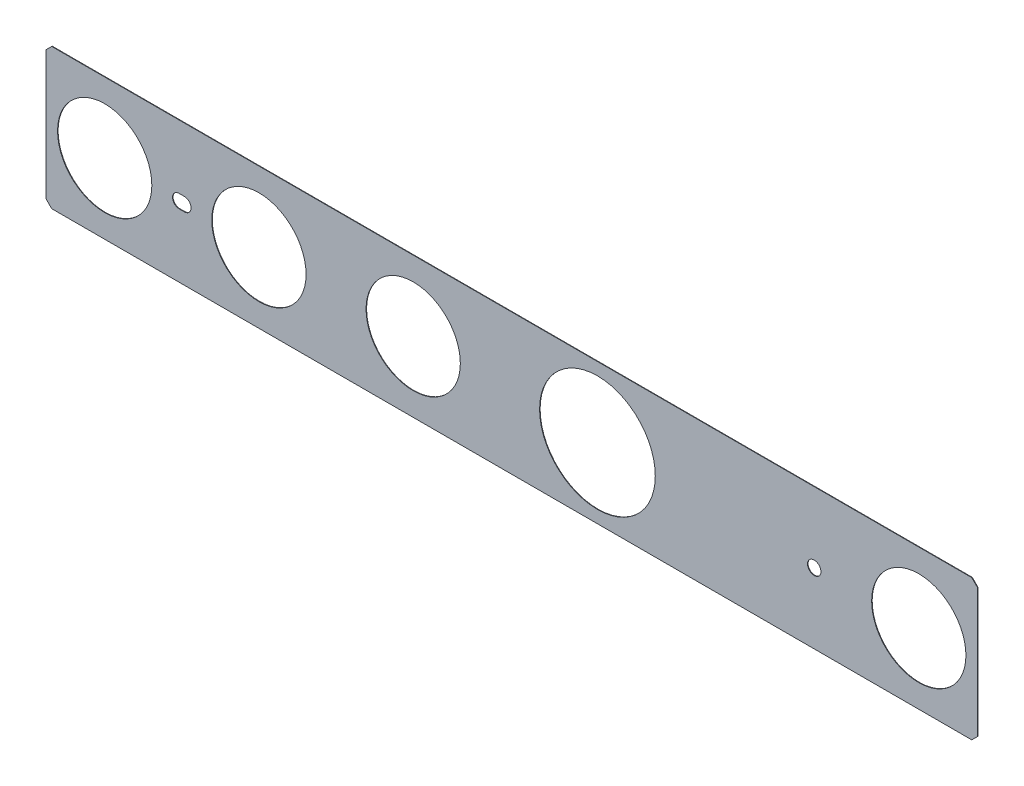
ISO-10303-21;
HEADER;
FILE_DESCRIPTION(('STEP AP214'),'2;1');
FILE_NAME('part.step','',(''),(''),'','','');
FILE_SCHEMA(('AUTOMOTIVE_DESIGN { 1 0 10303 214 1 1 1 1 }'));
ENDSEC;
DATA;
#1=APPLICATION_CONTEXT('core data for automotive mechanical design processes');
#2=APPLICATION_PROTOCOL_DEFINITION('international standard','automotive_design',2000,#1);
#3=PRODUCT_CONTEXT('',#1,'mechanical');
#4=PRODUCT('Part','Part','',(#3));
#5=PRODUCT_RELATED_PRODUCT_CATEGORY('part','',(#4));
#6=PRODUCT_DEFINITION_FORMATION('','',#4);
#7=PRODUCT_DEFINITION_CONTEXT('part definition',#1,'design');
#8=PRODUCT_DEFINITION('design','',#6,#7);
#9=PRODUCT_DEFINITION_SHAPE('','',#8);
#10=(LENGTH_UNIT() NAMED_UNIT(*) SI_UNIT(.MILLI.,.METRE.));
#11=(NAMED_UNIT(*) PLANE_ANGLE_UNIT() SI_UNIT($,.RADIAN.));
#12=(NAMED_UNIT(*) SI_UNIT($,.STERADIAN.) SOLID_ANGLE_UNIT());
#13=UNCERTAINTY_MEASURE_WITH_UNIT(LENGTH_MEASURE(1.E-05),#10,'distance_accuracy_value','');
#14=(GEOMETRIC_REPRESENTATION_CONTEXT(3) GLOBAL_UNCERTAINTY_ASSIGNED_CONTEXT((#13)) GLOBAL_UNIT_ASSIGNED_CONTEXT((#10,
#11,#12)) REPRESENTATION_CONTEXT('',''));
#15=CARTESIAN_POINT('',(0.,0.,0.));
#16=DIRECTION('',(0.,0.,1.));
#17=DIRECTION('',(1.,0.,0.));
#18=AXIS2_PLACEMENT_3D('',#15,#16,#17);
#19=CARTESIAN_POINT('',(-38.2,0.78,-2.41));
#20=DIRECTION('',(0.,1.,0.));
#21=DIRECTION('',(1.,0.,0.));
#22=AXIS2_PLACEMENT_3D('',#19,#20,#21);
#23=PLANE('',#22);
#24=DIRECTION('',(0.,0.,1.));
#25=VECTOR('',#24,1.);
#26=CARTESIAN_POINT('',(-38.2,0.78,-2.47));
#27=LINE('',#26,#25);
#28=CARTESIAN_POINT('',(-38.2,0.78,-2.47));
#29=VERTEX_POINT('',#28);
#30=CARTESIAN_POINT('',(-38.2,0.78,-2.41));
#31=VERTEX_POINT('',#30);
#32=EDGE_CURVE('E11',#29,#31,#27,.T.);
#33=ORIENTED_EDGE('',*,*,#32,.T.);
#34=DIRECTION('',(1.,0.,0.));
#35=VECTOR('',#34,1.);
#36=CARTESIAN_POINT('',(-38.8,0.78,-2.41));
#37=LINE('',#36,#35);
#38=CARTESIAN_POINT('',(-38.8,0.78,-2.41));
#39=VERTEX_POINT('',#38);
#40=EDGE_CURVE('E298',#39,#31,#37,.T.);
#41=ORIENTED_EDGE('',*,*,#40,.F.);
#42=DIRECTION('',(0.,0.,-1.));
#43=VECTOR('',#42,1.);
#44=CARTESIAN_POINT('',(-38.8,0.78,-2.41));
#45=LINE('',#44,#43);
#46=CARTESIAN_POINT('',(-38.8,0.78,-2.47));
#47=VERTEX_POINT('',#46);
#48=EDGE_CURVE('E432',#39,#47,#45,.T.);
#49=ORIENTED_EDGE('',*,*,#48,.T.);
#50=DIRECTION('',(1.,0.,0.));
#51=VECTOR('',#50,1.);
#52=CARTESIAN_POINT('',(-38.8,0.78,-2.47));
#53=LINE('',#52,#51);
#54=EDGE_CURVE('E400',#47,#29,#53,.T.);
#55=ORIENTED_EDGE('',*,*,#54,.T.);
#56=EDGE_LOOP('',(#33,#41,#49,#55));
#57=FACE_BOUND('',#56,.T.);
#58=ADVANCED_FACE('F17',(#57),#23,.F.);
#59=CARTESIAN_POINT('',(-38.2,0.,-2.41));
#60=DIRECTION('',(0.,0.,1.));
#61=DIRECTION('',(1.,0.,0.));
#62=AXIS2_PLACEMENT_3D('',#59,#60,#61);
#63=CYLINDRICAL_SURFACE('',#62,0.78);
#64=DIRECTION('',(0.,0.,-1.));
#65=VECTOR('',#64,1.);
#66=CARTESIAN_POINT('',(-38.2,-0.78,-2.41));
#67=LINE('',#66,#65);
#68=CARTESIAN_POINT('',(-38.2,-0.78,-2.41));
#69=VERTEX_POINT('',#68);
#70=CARTESIAN_POINT('',(-38.2,-0.78,-2.47));
#71=VERTEX_POINT('',#70);
#72=EDGE_CURVE('E28',#69,#71,#67,.T.);
#73=ORIENTED_EDGE('',*,*,#72,.F.);
#74=CARTESIAN_POINT('',(-38.2,0.,-2.41));
#75=DIRECTION('',(0.,0.,1.));
#76=DIRECTION('',(0.,-1.,0.));
#77=AXIS2_PLACEMENT_3D('',#74,#75,#76);
#78=CIRCLE('',#77,0.78);
#79=CARTESIAN_POINT('',(-37.42,0.,-2.41));
#80=VERTEX_POINT('',#79);
#81=EDGE_CURVE('E297',#69,#80,#78,.T.);
#82=ORIENTED_EDGE('',*,*,#81,.T.);
#83=CARTESIAN_POINT('',(-38.2,0.,-2.41));
#84=DIRECTION('',(0.,0.,1.));
#85=DIRECTION('',(1.,0.,0.));
#86=AXIS2_PLACEMENT_3D('',#83,#84,#85);
#87=CIRCLE('',#86,0.78);
#88=EDGE_CURVE('E294',#80,#31,#87,.T.);
#89=ORIENTED_EDGE('',*,*,#88,.T.);
#90=ORIENTED_EDGE('',*,*,#32,.F.);
#91=CARTESIAN_POINT('',(-38.2,0.,-2.47));
#92=DIRECTION('',(0.,0.,-1.));
#93=DIRECTION('',(0.,1.,0.));
#94=AXIS2_PLACEMENT_3D('',#91,#92,#93);
#95=CIRCLE('',#94,0.78);
#96=CARTESIAN_POINT('',(-37.42,0.,-2.47));
#97=VERTEX_POINT('',#96);
#98=EDGE_CURVE('E397',#29,#97,#95,.T.);
#99=ORIENTED_EDGE('',*,*,#98,.T.);
#100=CARTESIAN_POINT('',(-38.2,0.,-2.47));
#101=DIRECTION('',(0.,0.,-1.));
#102=DIRECTION('',(1.,0.,0.));
#103=AXIS2_PLACEMENT_3D('',#100,#101,#102);
#104=CIRCLE('',#103,0.78);
#105=EDGE_CURVE('E319',#97,#71,#104,.T.);
#106=ORIENTED_EDGE('',*,*,#105,.T.);
#107=EDGE_LOOP('',(#73,#82,#89,#90,#99,#106));
#108=FACE_BOUND('',#107,.T.);
#109=ADVANCED_FACE('F545',(#108),#63,.F.);
#110=CARTESIAN_POINT('',(-38.8,-0.78,-2.41));
#111=DIRECTION('',(0.,-1.,0.));
#112=DIRECTION('',(0.,0.,-1.));
#113=AXIS2_PLACEMENT_3D('',#110,#111,#112);
#114=PLANE('',#113);
#115=DIRECTION('',(0.,0.,1.));
#116=VECTOR('',#115,1.);
#117=CARTESIAN_POINT('',(-38.8,-0.78,-2.47));
#118=LINE('',#117,#116);
#119=CARTESIAN_POINT('',(-38.8,-0.78,-2.47));
#120=VERTEX_POINT('',#119);
#121=CARTESIAN_POINT('',(-38.8,-0.78,-2.41));
#122=VERTEX_POINT('',#121);
#123=EDGE_CURVE('E435',#120,#122,#118,.T.);
#124=ORIENTED_EDGE('',*,*,#123,.T.);
#125=DIRECTION('',(-1.,0.,0.));
#126=VECTOR('',#125,1.);
#127=CARTESIAN_POINT('',(-38.2,-0.78,-2.41));
#128=LINE('',#127,#126);
#129=EDGE_CURVE('E342',#69,#122,#128,.T.);
#130=ORIENTED_EDGE('',*,*,#129,.F.);
#131=ORIENTED_EDGE('',*,*,#72,.T.);
#132=DIRECTION('',(-1.,0.,0.));
#133=VECTOR('',#132,1.);
#134=CARTESIAN_POINT('',(-38.2,-0.78,-2.47));
#135=LINE('',#134,#133);
#136=EDGE_CURVE('E315',#71,#120,#135,.T.);
#137=ORIENTED_EDGE('',*,*,#136,.T.);
#138=EDGE_LOOP('',(#124,#130,#131,#137));
#139=FACE_BOUND('',#138,.T.);
#140=ADVANCED_FACE('F540',(#139),#114,.F.);
#141=CARTESIAN_POINT('',(-38.8,0.,-2.41));
#142=DIRECTION('',(0.,0.,1.));
#143=DIRECTION('',(1.,0.,0.));
#144=AXIS2_PLACEMENT_3D('',#141,#142,#143);
#145=CYLINDRICAL_SURFACE('',#144,0.78);
#146=ORIENTED_EDGE('',*,*,#48,.F.);
#147=CARTESIAN_POINT('',(-38.8,0.,-2.41));
#148=DIRECTION('',(0.,0.,1.));
#149=DIRECTION('',(0.,1.,0.));
#150=AXIS2_PLACEMENT_3D('',#147,#148,#149);
#151=CIRCLE('',#150,0.78);
#152=CARTESIAN_POINT('',(-39.58,0.,-2.41));
#153=VERTEX_POINT('',#152);
#154=EDGE_CURVE('E42',#39,#153,#151,.T.);
#155=ORIENTED_EDGE('',*,*,#154,.T.);
#156=CARTESIAN_POINT('',(-38.8,0.,-2.41));
#157=DIRECTION('',(0.,0.,1.));
#158=DIRECTION('',(-1.,0.,0.));
#159=AXIS2_PLACEMENT_3D('',#156,#157,#158);
#160=CIRCLE('',#159,0.78);
#161=EDGE_CURVE('E423',#153,#122,#160,.T.);
#162=ORIENTED_EDGE('',*,*,#161,.T.);
#163=ORIENTED_EDGE('',*,*,#123,.F.);
#164=CARTESIAN_POINT('',(-38.8,0.,-2.47));
#165=DIRECTION('',(0.,0.,-1.));
#166=DIRECTION('',(0.,-1.,0.));
#167=AXIS2_PLACEMENT_3D('',#164,#165,#166);
#168=CIRCLE('',#167,0.78);
#169=CARTESIAN_POINT('',(-39.58,0.,-2.47));
#170=VERTEX_POINT('',#169);
#171=EDGE_CURVE('E310',#120,#170,#168,.T.);
#172=ORIENTED_EDGE('',*,*,#171,.T.);
#173=CARTESIAN_POINT('',(-38.8,0.,-2.47));
#174=DIRECTION('',(0.,0.,-1.));
#175=DIRECTION('',(-1.,0.,0.));
#176=AXIS2_PLACEMENT_3D('',#173,#174,#175);
#177=CIRCLE('',#176,0.78);
#178=EDGE_CURVE('E314',#170,#47,#177,.T.);
#179=ORIENTED_EDGE('',*,*,#178,.T.);
#180=EDGE_LOOP('',(#146,#155,#162,#163,#172,#179));
#181=FACE_BOUND('',#180,.T.);
#182=ADVANCED_FACE('F553',(#181),#145,.F.);
#183=CARTESIAN_POINT('',(35.3,0.,-2.41));
#184=DIRECTION('',(0.,0.,1.));
#185=DIRECTION('',(1.,0.,0.));
#186=AXIS2_PLACEMENT_3D('',#183,#184,#185);
#187=CYLINDRICAL_SURFACE('',#186,0.78);
#188=DIRECTION('',(0.,0.,1.));
#189=VECTOR('',#188,1.);
#190=CARTESIAN_POINT('',(34.52,0.,-2.47));
#191=LINE('',#190,#189);
#192=CARTESIAN_POINT('',(34.52,0.,-2.47));
#193=VERTEX_POINT('',#192);
#194=CARTESIAN_POINT('',(34.52,0.,-2.41));
#195=VERTEX_POINT('',#194);
#196=EDGE_CURVE('E303',#193,#195,#191,.T.);
#197=ORIENTED_EDGE('',*,*,#196,.T.);
#198=CARTESIAN_POINT('',(35.3,0.,-2.41));
#199=DIRECTION('',(0.,0.,1.));
#200=DIRECTION('',(-1.,0.,0.));
#201=AXIS2_PLACEMENT_3D('',#198,#199,#200);
#202=CIRCLE('',#201,0.78);
#203=CARTESIAN_POINT('',(36.08,0.,-2.41));
#204=VERTEX_POINT('',#203);
#205=EDGE_CURVE('E363',#195,#204,#202,.T.);
#206=ORIENTED_EDGE('',*,*,#205,.T.);
#207=DIRECTION('',(0.,0.,1.));
#208=VECTOR('',#207,1.);
#209=CARTESIAN_POINT('',(36.08,0.,-2.47));
#210=LINE('',#209,#208);
#211=CARTESIAN_POINT('',(36.08,0.,-2.47));
#212=VERTEX_POINT('',#211);
#213=EDGE_CURVE('E300',#212,#204,#210,.T.);
#214=ORIENTED_EDGE('',*,*,#213,.F.);
#215=CARTESIAN_POINT('',(35.3,0.,-2.47));
#216=DIRECTION('',(0.,0.,-1.));
#217=DIRECTION('',(1.,0.,0.));
#218=AXIS2_PLACEMENT_3D('',#215,#216,#217);
#219=CIRCLE('',#218,0.78);
#220=EDGE_CURVE('E324',#212,#193,#219,.T.);
#221=ORIENTED_EDGE('',*,*,#220,.T.);
#222=EDGE_LOOP('',(#197,#206,#214,#221));
#223=FACE_BOUND('',#222,.T.);
#224=ADVANCED_FACE('F613',(#223),#187,.F.);
#225=CARTESIAN_POINT('',(35.3,0.,-2.41));
#226=DIRECTION('',(0.,0.,1.));
#227=DIRECTION('',(1.,0.,0.));
#228=AXIS2_PLACEMENT_3D('',#225,#226,#227);
#229=CYLINDRICAL_SURFACE('',#228,0.78);
#230=ORIENTED_EDGE('',*,*,#213,.T.);
#231=CARTESIAN_POINT('',(35.3,0.,-2.41));
#232=DIRECTION('',(0.,0.,1.));
#233=DIRECTION('',(1.,0.,0.));
#234=AXIS2_PLACEMENT_3D('',#231,#232,#233);
#235=CIRCLE('',#234,0.78);
#236=EDGE_CURVE('E367',#204,#195,#235,.T.);
#237=ORIENTED_EDGE('',*,*,#236,.T.);
#238=ORIENTED_EDGE('',*,*,#196,.F.);
#239=CARTESIAN_POINT('',(35.3,0.,-2.47));
#240=DIRECTION('',(0.,0.,-1.));
#241=DIRECTION('',(-1.,0.,0.));
#242=AXIS2_PLACEMENT_3D('',#239,#240,#241);
#243=CIRCLE('',#242,0.78);
#244=EDGE_CURVE('E320',#193,#212,#243,.T.);
#245=ORIENTED_EDGE('',*,*,#244,.T.);
#246=EDGE_LOOP('',(#230,#237,#238,#245));
#247=FACE_BOUND('',#246,.T.);
#248=ADVANCED_FACE('F603',(#247),#229,.F.);
#249=CARTESIAN_POINT('',(47.5,0.,-2.47));
#250=DIRECTION('',(0.,0.,1.));
#251=DIRECTION('',(1.,0.,0.));
#252=AXIS2_PLACEMENT_3D('',#249,#250,#251);
#253=CYLINDRICAL_SURFACE('',#252,5.5);
#254=DIRECTION('',(0.,0.,1.));
#255=VECTOR('',#254,1.);
#256=CARTESIAN_POINT('',(42.,0.,-2.47));
#257=LINE('',#256,#255);
#258=CARTESIAN_POINT('',(42.,0.,-2.47));
#259=VERTEX_POINT('',#258);
#260=CARTESIAN_POINT('',(42.,0.,-2.41));
#261=VERTEX_POINT('',#260);
#262=EDGE_CURVE('E304',#259,#261,#257,.T.);
#263=ORIENTED_EDGE('',*,*,#262,.T.);
#264=CARTESIAN_POINT('',(47.5,0.,-2.41));
#265=DIRECTION('',(0.,0.,1.));
#266=DIRECTION('',(-1.,0.,0.));
#267=AXIS2_PLACEMENT_3D('',#264,#265,#266);
#268=CIRCLE('',#267,5.5);
#269=CARTESIAN_POINT('',(53.,0.,-2.41));
#270=VERTEX_POINT('',#269);
#271=EDGE_CURVE('E396',#261,#270,#268,.T.);
#272=ORIENTED_EDGE('',*,*,#271,.T.);
#273=DIRECTION('',(0.,0.,1.));
#274=VECTOR('',#273,1.);
#275=CARTESIAN_POINT('',(53.,0.,-2.47));
#276=LINE('',#275,#274);
#277=CARTESIAN_POINT('',(53.,0.,-2.47));
#278=VERTEX_POINT('',#277);
#279=EDGE_CURVE('E360',#278,#270,#276,.T.);
#280=ORIENTED_EDGE('',*,*,#279,.F.);
#281=CARTESIAN_POINT('',(47.5,0.,-2.47));
#282=DIRECTION('',(0.,0.,-1.));
#283=DIRECTION('',(1.,0.,0.));
#284=AXIS2_PLACEMENT_3D('',#281,#282,#283);
#285=CIRCLE('',#284,5.5);
#286=EDGE_CURVE('E381',#278,#259,#285,.T.);
#287=ORIENTED_EDGE('',*,*,#286,.T.);
#288=EDGE_LOOP('',(#263,#272,#280,#287));
#289=FACE_BOUND('',#288,.T.);
#290=ADVANCED_FACE('F600',(#289),#253,.F.);
#291=CARTESIAN_POINT('',(47.5,0.,-2.47));
#292=DIRECTION('',(0.,0.,1.));
#293=DIRECTION('',(1.,0.,0.));
#294=AXIS2_PLACEMENT_3D('',#291,#292,#293);
#295=CYLINDRICAL_SURFACE('',#294,5.5);
#296=ORIENTED_EDGE('',*,*,#279,.T.);
#297=CARTESIAN_POINT('',(47.5,0.,-2.41));
#298=DIRECTION('',(0.,0.,1.));
#299=DIRECTION('',(1.,0.,0.));
#300=AXIS2_PLACEMENT_3D('',#297,#298,#299);
#301=CIRCLE('',#300,5.5);
#302=EDGE_CURVE('E368',#270,#261,#301,.T.);
#303=ORIENTED_EDGE('',*,*,#302,.T.);
#304=ORIENTED_EDGE('',*,*,#262,.F.);
#305=CARTESIAN_POINT('',(47.5,0.,-2.47));
#306=DIRECTION('',(0.,0.,-1.));
#307=DIRECTION('',(-1.,0.,0.));
#308=AXIS2_PLACEMENT_3D('',#305,#306,#307);
#309=CIRCLE('',#308,5.5);
#310=EDGE_CURVE('E351',#259,#278,#309,.T.);
#311=ORIENTED_EDGE('',*,*,#310,.T.);
#312=EDGE_LOOP('',(#296,#303,#304,#311));
#313=FACE_BOUND('',#312,.T.);
#314=ADVANCED_FACE('F19',(#313),#295,.F.);
#315=CARTESIAN_POINT('',(-47.5,0.,-2.47));
#316=DIRECTION('',(0.,0.,1.));
#317=DIRECTION('',(1.,0.,0.));
#318=AXIS2_PLACEMENT_3D('',#315,#316,#317);
#319=CYLINDRICAL_SURFACE('',#318,5.5);
#320=DIRECTION('',(0.,0.,1.));
#321=VECTOR('',#320,1.);
#322=CARTESIAN_POINT('',(-42.,0.,-2.47));
#323=LINE('',#322,#321);
#324=CARTESIAN_POINT('',(-42.,0.,-2.47));
#325=VERTEX_POINT('',#324);
#326=CARTESIAN_POINT('',(-42.,0.,-2.41));
#327=VERTEX_POINT('',#326);
#328=EDGE_CURVE('E147',#325,#327,#323,.T.);
#329=ORIENTED_EDGE('',*,*,#328,.T.);
#330=CARTESIAN_POINT('',(-47.5,0.,-2.41));
#331=DIRECTION('',(0.,0.,1.));
#332=DIRECTION('',(1.,0.,0.));
#333=AXIS2_PLACEMENT_3D('',#330,#331,#332);
#334=CIRCLE('',#333,5.5);
#335=CARTESIAN_POINT('',(-53.,0.,-2.41));
#336=VERTEX_POINT('',#335);
#337=EDGE_CURVE('E417',#327,#336,#334,.T.);
#338=ORIENTED_EDGE('',*,*,#337,.T.);
#339=DIRECTION('',(0.,0.,1.));
#340=VECTOR('',#339,1.);
#341=CARTESIAN_POINT('',(-53.,0.,-2.47));
#342=LINE('',#341,#340);
#343=CARTESIAN_POINT('',(-53.,0.,-2.47));
#344=VERTEX_POINT('',#343);
#345=EDGE_CURVE('E359',#344,#336,#342,.T.);
#346=ORIENTED_EDGE('',*,*,#345,.F.);
#347=CARTESIAN_POINT('',(-47.5,0.,-2.47));
#348=DIRECTION('',(0.,0.,-1.));
#349=DIRECTION('',(-1.,0.,0.));
#350=AXIS2_PLACEMENT_3D('',#347,#348,#349);
#351=CIRCLE('',#350,5.5);
#352=EDGE_CURVE('E305',#344,#325,#351,.T.);
#353=ORIENTED_EDGE('',*,*,#352,.T.);
#354=EDGE_LOOP('',(#329,#338,#346,#353));
#355=FACE_BOUND('',#354,.T.);
#356=ADVANCED_FACE('F588',(#355),#319,.F.);
#357=CARTESIAN_POINT('',(-47.5,0.,-2.47));
#358=DIRECTION('',(0.,0.,1.));
#359=DIRECTION('',(1.,0.,0.));
#360=AXIS2_PLACEMENT_3D('',#357,#358,#359);
#361=CYLINDRICAL_SURFACE('',#360,5.5);
#362=ORIENTED_EDGE('',*,*,#345,.T.);
#363=CARTESIAN_POINT('',(-47.5,0.,-2.41));
#364=DIRECTION('',(0.,0.,1.));
#365=DIRECTION('',(-1.,0.,0.));
#366=AXIS2_PLACEMENT_3D('',#363,#364,#365);
#367=CIRCLE('',#366,5.5);
#368=EDGE_CURVE('E21',#336,#327,#367,.T.);
#369=ORIENTED_EDGE('',*,*,#368,.T.);
#370=ORIENTED_EDGE('',*,*,#328,.F.);
#371=CARTESIAN_POINT('',(-47.5,0.,-2.47));
#372=DIRECTION('',(0.,0.,-1.));
#373=DIRECTION('',(1.,0.,0.));
#374=AXIS2_PLACEMENT_3D('',#371,#372,#373);
#375=CIRCLE('',#374,5.5);
#376=EDGE_CURVE('E308',#325,#344,#375,.T.);
#377=ORIENTED_EDGE('',*,*,#376,.T.);
#378=EDGE_LOOP('',(#362,#369,#370,#377));
#379=FACE_BOUND('',#378,.T.);
#380=ADVANCED_FACE('F591',(#379),#361,.F.);
#381=CARTESIAN_POINT('',(-11.5,0.,-2.47));
#382=DIRECTION('',(0.,0.,1.));
#383=DIRECTION('',(1.,0.,0.));
#384=AXIS2_PLACEMENT_3D('',#381,#382,#383);
#385=CYLINDRICAL_SURFACE('',#384,5.5);
#386=DIRECTION('',(0.,0.,-1.));
#387=VECTOR('',#386,1.);
#388=CARTESIAN_POINT('',(-6.,0.,-2.41));
#389=LINE('',#388,#387);
#390=CARTESIAN_POINT('',(-6.,0.,-2.41));
#391=VERTEX_POINT('',#390);
#392=CARTESIAN_POINT('',(-6.,0.,-2.47));
#393=VERTEX_POINT('',#392);
#394=EDGE_CURVE('E356',#391,#393,#389,.T.);
#395=ORIENTED_EDGE('',*,*,#394,.F.);
#396=CARTESIAN_POINT('',(-11.5,0.,-2.41));
#397=DIRECTION('',(0.,0.,1.));
#398=DIRECTION('',(1.,0.,0.));
#399=AXIS2_PLACEMENT_3D('',#396,#397,#398);
#400=CIRCLE('',#399,5.5);
#401=CARTESIAN_POINT('',(-17.,0.,-2.41));
#402=VERTEX_POINT('',#401);
#403=EDGE_CURVE('E428',#391,#402,#400,.T.);
#404=ORIENTED_EDGE('',*,*,#403,.T.);
#405=DIRECTION('',(0.,0.,-1.));
#406=VECTOR('',#405,1.);
#407=CARTESIAN_POINT('',(-17.,0.,-2.41));
#408=LINE('',#407,#406);
#409=CARTESIAN_POINT('',(-17.,0.,-2.47));
#410=VERTEX_POINT('',#409);
#411=EDGE_CURVE('E163',#402,#410,#408,.T.);
#412=ORIENTED_EDGE('',*,*,#411,.T.);
#413=CARTESIAN_POINT('',(-11.5,0.,-2.47));
#414=DIRECTION('',(0.,0.,-1.));
#415=DIRECTION('',(-1.,0.,0.));
#416=AXIS2_PLACEMENT_3D('',#413,#414,#415);
#417=CIRCLE('',#416,5.5);
#418=EDGE_CURVE('E422',#410,#393,#417,.T.);
#419=ORIENTED_EDGE('',*,*,#418,.T.);
#420=EDGE_LOOP('',(#395,#404,#412,#419));
#421=FACE_BOUND('',#420,.T.);
#422=ADVANCED_FACE('F607',(#421),#385,.F.);
#423=CARTESIAN_POINT('',(-11.5,0.,-2.47));
#424=DIRECTION('',(0.,0.,1.));
#425=DIRECTION('',(1.,0.,0.));
#426=AXIS2_PLACEMENT_3D('',#423,#424,#425);
#427=CYLINDRICAL_SURFACE('',#426,5.5);
#428=ORIENTED_EDGE('',*,*,#411,.F.);
#429=CARTESIAN_POINT('',(-11.5,0.,-2.41));
#430=DIRECTION('',(0.,0.,1.));
#431=DIRECTION('',(-1.,0.,0.));
#432=AXIS2_PLACEMENT_3D('',#429,#430,#431);
#433=CIRCLE('',#432,5.5);
#434=EDGE_CURVE('E419',#402,#391,#433,.T.);
#435=ORIENTED_EDGE('',*,*,#434,.T.);
#436=ORIENTED_EDGE('',*,*,#394,.T.);
#437=CARTESIAN_POINT('',(-11.5,0.,-2.47));
#438=DIRECTION('',(0.,0.,-1.));
#439=DIRECTION('',(1.,0.,0.));
#440=AXIS2_PLACEMENT_3D('',#437,#438,#439);
#441=CIRCLE('',#440,5.5);
#442=EDGE_CURVE('E309',#393,#410,#441,.T.);
#443=ORIENTED_EDGE('',*,*,#442,.T.);
#444=EDGE_LOOP('',(#428,#435,#436,#443));
#445=FACE_BOUND('',#444,.T.);
#446=ADVANCED_FACE('F595',(#445),#427,.F.);
#447=CARTESIAN_POINT('',(10.,0.,-2.47));
#448=DIRECTION('',(0.,0.,1.));
#449=DIRECTION('',(1.,0.,0.));
#450=AXIS2_PLACEMENT_3D('',#447,#448,#449);
#451=CYLINDRICAL_SURFACE('',#450,6.75);
#452=DIRECTION('',(0.,0.,-1.));
#453=VECTOR('',#452,1.);
#454=CARTESIAN_POINT('',(16.75,0.,-2.41));
#455=LINE('',#454,#453);
#456=CARTESIAN_POINT('',(16.75,0.,-2.41));
#457=VERTEX_POINT('',#456);
#458=CARTESIAN_POINT('',(16.75,0.,-2.47));
#459=VERTEX_POINT('',#458);
#460=EDGE_CURVE('E352',#457,#459,#455,.T.);
#461=ORIENTED_EDGE('',*,*,#460,.F.);
#462=CARTESIAN_POINT('',(10.,0.,-2.41));
#463=DIRECTION('',(0.,0.,1.));
#464=DIRECTION('',(1.,0.,0.));
#465=AXIS2_PLACEMENT_3D('',#462,#463,#464);
#466=CIRCLE('',#465,6.75);
#467=CARTESIAN_POINT('',(3.25,0.,-2.41));
#468=VERTEX_POINT('',#467);
#469=EDGE_CURVE('E334',#457,#468,#466,.T.);
#470=ORIENTED_EDGE('',*,*,#469,.T.);
#471=DIRECTION('',(0.,0.,-1.));
#472=VECTOR('',#471,1.);
#473=CARTESIAN_POINT('',(3.25,0.,-2.41));
#474=LINE('',#473,#472);
#475=CARTESIAN_POINT('',(3.25,0.,-2.47));
#476=VERTEX_POINT('',#475);
#477=EDGE_CURVE('E355',#468,#476,#474,.T.);
#478=ORIENTED_EDGE('',*,*,#477,.T.);
#479=CARTESIAN_POINT('',(10.,0.,-2.47));
#480=DIRECTION('',(0.,0.,-1.));
#481=DIRECTION('',(-1.,0.,0.));
#482=AXIS2_PLACEMENT_3D('',#479,#480,#481);
#483=CIRCLE('',#482,6.75);
#484=EDGE_CURVE('E438',#476,#459,#483,.T.);
#485=ORIENTED_EDGE('',*,*,#484,.T.);
#486=EDGE_LOOP('',(#461,#470,#478,#485));
#487=FACE_BOUND('',#486,.T.);
#488=ADVANCED_FACE('F592',(#487),#451,.F.);
#489=CARTESIAN_POINT('',(10.,0.,-2.47));
#490=DIRECTION('',(0.,0.,1.));
#491=DIRECTION('',(1.,0.,0.));
#492=AXIS2_PLACEMENT_3D('',#489,#490,#491);
#493=CYLINDRICAL_SURFACE('',#492,6.75);
#494=ORIENTED_EDGE('',*,*,#477,.F.);
#495=CARTESIAN_POINT('',(10.,0.,-2.41));
#496=DIRECTION('',(0.,0.,1.));
#497=DIRECTION('',(-1.,0.,0.));
#498=AXIS2_PLACEMENT_3D('',#495,#496,#497);
#499=CIRCLE('',#498,6.75);
#500=EDGE_CURVE('E338',#468,#457,#499,.T.);
#501=ORIENTED_EDGE('',*,*,#500,.T.);
#502=ORIENTED_EDGE('',*,*,#460,.T.);
#503=CARTESIAN_POINT('',(10.,0.,-2.47));
#504=DIRECTION('',(0.,0.,-1.));
#505=DIRECTION('',(1.,0.,0.));
#506=AXIS2_PLACEMENT_3D('',#503,#504,#505);
#507=CIRCLE('',#506,6.75);
#508=EDGE_CURVE('E458',#459,#476,#507,.T.);
#509=ORIENTED_EDGE('',*,*,#508,.T.);
#510=EDGE_LOOP('',(#494,#501,#502,#509));
#511=FACE_BOUND('',#510,.T.);
#512=ADVANCED_FACE('F584',(#511),#493,.F.);
#513=CARTESIAN_POINT('',(-29.5,0.,-2.47));
#514=DIRECTION('',(0.,0.,1.));
#515=DIRECTION('',(1.,0.,0.));
#516=AXIS2_PLACEMENT_3D('',#513,#514,#515);
#517=CYLINDRICAL_SURFACE('',#516,5.5);
#518=DIRECTION('',(0.,0.,-1.));
#519=VECTOR('',#518,1.);
#520=CARTESIAN_POINT('',(-24.,0.,-2.41));
#521=LINE('',#520,#519);
#522=CARTESIAN_POINT('',(-24.,0.,-2.41));
#523=VERTEX_POINT('',#522);
#524=CARTESIAN_POINT('',(-24.,0.,-2.47));
#525=VERTEX_POINT('',#524);
#526=EDGE_CURVE('E467',#523,#525,#521,.T.);
#527=ORIENTED_EDGE('',*,*,#526,.F.);
#528=CARTESIAN_POINT('',(-29.5,0.,-2.41));
#529=DIRECTION('',(0.,0.,1.));
#530=DIRECTION('',(1.,0.,0.));
#531=AXIS2_PLACEMENT_3D('',#528,#529,#530);
#532=CIRCLE('',#531,5.5);
#533=CARTESIAN_POINT('',(-35.,0.,-2.41));
#534=VERTEX_POINT('',#533);
#535=EDGE_CURVE('E346',#523,#534,#532,.T.);
#536=ORIENTED_EDGE('',*,*,#535,.T.);
#537=DIRECTION('',(0.,0.,-1.));
#538=VECTOR('',#537,1.);
#539=CARTESIAN_POINT('',(-35.,0.,-2.41));
#540=LINE('',#539,#538);
#541=CARTESIAN_POINT('',(-35.,0.,-2.47));
#542=VERTEX_POINT('',#541);
#543=EDGE_CURVE('E515',#534,#542,#540,.T.);
#544=ORIENTED_EDGE('',*,*,#543,.T.);
#545=CARTESIAN_POINT('',(-29.5,0.,-2.47));
#546=DIRECTION('',(0.,0.,-1.));
#547=DIRECTION('',(-1.,0.,0.));
#548=AXIS2_PLACEMENT_3D('',#545,#546,#547);
#549=CIRCLE('',#548,5.5);
#550=EDGE_CURVE('E274',#542,#525,#549,.T.);
#551=ORIENTED_EDGE('',*,*,#550,.T.);
#552=EDGE_LOOP('',(#527,#536,#544,#551));
#553=FACE_BOUND('',#552,.T.);
#554=ADVANCED_FACE('F580',(#553),#517,.F.);
#555=CARTESIAN_POINT('',(-29.5,0.,-2.47));
#556=DIRECTION('',(0.,0.,1.));
#557=DIRECTION('',(1.,0.,0.));
#558=AXIS2_PLACEMENT_3D('',#555,#556,#557);
#559=CYLINDRICAL_SURFACE('',#558,5.5);
#560=ORIENTED_EDGE('',*,*,#543,.F.);
#561=CARTESIAN_POINT('',(-29.5,0.,-2.41));
#562=DIRECTION('',(0.,0.,1.));
#563=DIRECTION('',(-1.,0.,0.));
#564=AXIS2_PLACEMENT_3D('',#561,#562,#563);
#565=CIRCLE('',#564,5.5);
#566=EDGE_CURVE('E339',#534,#523,#565,.T.);
#567=ORIENTED_EDGE('',*,*,#566,.T.);
#568=ORIENTED_EDGE('',*,*,#526,.T.);
#569=CARTESIAN_POINT('',(-29.5,0.,-2.47));
#570=DIRECTION('',(0.,0.,-1.));
#571=DIRECTION('',(1.,0.,0.));
#572=AXIS2_PLACEMENT_3D('',#569,#570,#571);
#573=CIRCLE('',#572,5.5);
#574=EDGE_CURVE('E333',#525,#542,#573,.T.);
#575=ORIENTED_EDGE('',*,*,#574,.T.);
#576=EDGE_LOOP('',(#560,#567,#568,#575));
#577=FACE_BOUND('',#576,.T.);
#578=ADVANCED_FACE('F583',(#577),#559,.F.);
#579=CARTESIAN_POINT('',(0.,0.,-2.41));
#580=DIRECTION('',(0.,0.,1.));
#581=DIRECTION('',(1.,0.,0.));
#582=AXIS2_PLACEMENT_3D('',#579,#580,#581);
#583=PLANE('',#582);
#584=ORIENTED_EDGE('',*,*,#40,.T.);
#585=ORIENTED_EDGE('',*,*,#88,.F.);
#586=ORIENTED_EDGE('',*,*,#81,.F.);
#587=ORIENTED_EDGE('',*,*,#129,.T.);
#588=ORIENTED_EDGE('',*,*,#161,.F.);
#589=ORIENTED_EDGE('',*,*,#154,.F.);
#590=EDGE_LOOP('',(#584,#585,#586,#587,#588,#589));
#591=FACE_BOUND('',#590,.T.);
#592=ORIENTED_EDGE('',*,*,#205,.F.);
#593=ORIENTED_EDGE('',*,*,#236,.F.);
#594=EDGE_LOOP('',(#592,#593));
#595=FACE_BOUND('',#594,.T.);
#596=ORIENTED_EDGE('',*,*,#271,.F.);
#597=ORIENTED_EDGE('',*,*,#302,.F.);
#598=EDGE_LOOP('',(#596,#597));
#599=FACE_BOUND('',#598,.T.);
#600=ORIENTED_EDGE('',*,*,#337,.F.);
#601=ORIENTED_EDGE('',*,*,#368,.F.);
#602=EDGE_LOOP('',(#600,#601));
#603=FACE_BOUND('',#602,.T.);
#604=ORIENTED_EDGE('',*,*,#403,.F.);
#605=ORIENTED_EDGE('',*,*,#434,.F.);
#606=EDGE_LOOP('',(#604,#605));
#607=FACE_BOUND('',#606,.T.);
#608=ORIENTED_EDGE('',*,*,#469,.F.);
#609=ORIENTED_EDGE('',*,*,#500,.F.);
#610=EDGE_LOOP('',(#608,#609));
#611=FACE_BOUND('',#610,.T.);
#612=ORIENTED_EDGE('',*,*,#535,.F.);
#613=ORIENTED_EDGE('',*,*,#566,.F.);
#614=EDGE_LOOP('',(#612,#613));
#615=FACE_BOUND('',#614,.T.);
#616=DIRECTION('',(0.707106781187098,0.707106781185998,0.));
#617=VECTOR('',#616,1.);
#618=CARTESIAN_POINT('',(-54.35,7.532893218813,-2.41));
#619=LINE('',#618,#617);
#620=CARTESIAN_POINT('',(-54.35,7.532893218813,-2.41));
#621=VERTEX_POINT('',#620);
#622=CARTESIAN_POINT('',(-53.68289321881,8.2,-2.41));
#623=VERTEX_POINT('',#622);
#624=EDGE_CURVE('E343',#621,#623,#619,.T.);
#625=ORIENTED_EDGE('',*,*,#624,.F.);
#626=DIRECTION('',(0.,-1.,0.));
#627=VECTOR('',#626,1.);
#628=CARTESIAN_POINT('',(-54.35,7.532893218813,-2.41));
#629=LINE('',#628,#627);
#630=CARTESIAN_POINT('',(-54.35,-7.532893218812,-2.41));
#631=VERTEX_POINT('',#630);
#632=EDGE_CURVE('E386',#621,#631,#629,.T.);
#633=ORIENTED_EDGE('',*,*,#632,.T.);
#634=DIRECTION('',(-0.707106781187098,0.707106781185998,0.));
#635=VECTOR('',#634,1.);
#636=CARTESIAN_POINT('',(-53.68289321881,-8.200000000001,-2.41));
#637=LINE('',#636,#635);
#638=CARTESIAN_POINT('',(-53.68289321881,-8.2,-2.41));
#639=VERTEX_POINT('',#638);
#640=EDGE_CURVE('E387',#639,#631,#637,.T.);
#641=ORIENTED_EDGE('',*,*,#640,.F.);
#642=DIRECTION('',(1.,0.,0.));
#643=VECTOR('',#642,1.);
#644=CARTESIAN_POINT('',(-53.68289321881,-8.2,-2.41));
#645=LINE('',#644,#643);
#646=CARTESIAN_POINT('',(53.68289321881,-8.2,-2.41));
#647=VERTEX_POINT('',#646);
#648=EDGE_CURVE('E403',#639,#647,#645,.T.);
#649=ORIENTED_EDGE('',*,*,#648,.T.);
#650=DIRECTION('',(-0.707106781187098,-0.707106781185998,0.));
#651=VECTOR('',#650,1.);
#652=CARTESIAN_POINT('',(54.35,-7.532893218813,-2.41));
#653=LINE('',#652,#651);
#654=CARTESIAN_POINT('',(54.35,-7.532893218813,-2.41));
#655=VERTEX_POINT('',#654);
#656=EDGE_CURVE('E329',#655,#647,#653,.T.);
#657=ORIENTED_EDGE('',*,*,#656,.F.);
#658=DIRECTION('',(0.,1.,0.));
#659=VECTOR('',#658,1.);
#660=CARTESIAN_POINT('',(54.35,-7.532893218813,-2.41));
#661=LINE('',#660,#659);
#662=CARTESIAN_POINT('',(54.35,7.532893218812,-2.41));
#663=VERTEX_POINT('',#662);
#664=EDGE_CURVE('E293',#655,#663,#661,.T.);
#665=ORIENTED_EDGE('',*,*,#664,.T.);
#666=DIRECTION('',(0.707106781187098,-0.707106781185998,0.));
#667=VECTOR('',#666,1.);
#668=CARTESIAN_POINT('',(53.68289321881,8.200000000001,-2.41));
#669=LINE('',#668,#667);
#670=CARTESIAN_POINT('',(53.68289321881,8.2,-2.41));
#671=VERTEX_POINT('',#670);
#672=EDGE_CURVE('E263',#671,#663,#669,.T.);
#673=ORIENTED_EDGE('',*,*,#672,.F.);
#674=DIRECTION('',(-1.,0.,0.));
#675=VECTOR('',#674,1.);
#676=CARTESIAN_POINT('',(53.68289321881,8.2,-2.41));
#677=LINE('',#676,#675);
#678=EDGE_CURVE('E258',#671,#623,#677,.T.);
#679=ORIENTED_EDGE('',*,*,#678,.T.);
#680=EDGE_LOOP('',(#625,#633,#641,#649,#657,#665,#673,#679));
#681=FACE_BOUND('',#680,.T.);
#682=ADVANCED_FACE('F554',(#591,#595,#599,#603,#607,#611,#615,#681),#583,.T.);
#683=CARTESIAN_POINT('',(-53.68289321881,8.2,-2.47));
#684=DIRECTION('',(-0.707106781186548,0.707106781186548,0.));
#685=DIRECTION('',(0.,0.,1.));
#686=AXIS2_PLACEMENT_3D('',#683,#684,#685);
#687=PLANE('',#686);
#688=DIRECTION('',(2.368475785867E-13,0.,1.));
#689=VECTOR('',#688,1.);
#690=CARTESIAN_POINT('',(-54.35,7.532893218813,-2.47));
#691=LINE('',#690,#689);
#692=CARTESIAN_POINT('',(-54.35,7.532893218813,-2.47));
#693=VERTEX_POINT('',#692);
#694=EDGE_CURVE('E347',#693,#621,#691,.T.);
#695=ORIENTED_EDGE('',*,*,#694,.T.);
#696=ORIENTED_EDGE('',*,*,#624,.T.);
#697=DIRECTION('',(0.,0.,1.));
#698=VECTOR('',#697,1.);
#699=CARTESIAN_POINT('',(-53.68289321881,8.2,-2.47));
#700=LINE('',#699,#698);
#701=CARTESIAN_POINT('',(-53.68289321881,8.2,-2.47));
#702=VERTEX_POINT('',#701);
#703=EDGE_CURVE('E313',#702,#623,#700,.T.);
#704=ORIENTED_EDGE('',*,*,#703,.F.);
#705=DIRECTION('',(-0.707106781187098,-0.707106781185998,0.));
#706=VECTOR('',#705,1.);
#707=CARTESIAN_POINT('',(-53.68289321881,8.2,-2.47));
#708=LINE('',#707,#706);
#709=EDGE_CURVE('E272',#702,#693,#708,.T.);
#710=ORIENTED_EDGE('',*,*,#709,.T.);
#711=EDGE_LOOP('',(#695,#696,#704,#710));
#712=FACE_BOUND('',#711,.T.);
#713=ADVANCED_FACE('F574',(#712),#687,.T.);
#714=CARTESIAN_POINT('',(-54.35,7.532893218813,-2.47));
#715=DIRECTION('',(-1.,0.,0.));
#716=DIRECTION('',(0.,0.,1.));
#717=AXIS2_PLACEMENT_3D('',#714,#715,#716);
#718=PLANE('',#717);
#719=DIRECTION('',(0.,0.,1.));
#720=VECTOR('',#719,1.);
#721=CARTESIAN_POINT('',(-54.35,-7.532893218812,-2.47));
#722=LINE('',#721,#720);
#723=CARTESIAN_POINT('',(-54.35,-7.532893218812,-2.47));
#724=VERTEX_POINT('',#723);
#725=EDGE_CURVE('E382',#724,#631,#722,.T.);
#726=ORIENTED_EDGE('',*,*,#725,.T.);
#727=ORIENTED_EDGE('',*,*,#632,.F.);
#728=ORIENTED_EDGE('',*,*,#694,.F.);
#729=DIRECTION('',(0.,-1.,0.));
#730=VECTOR('',#729,1.);
#731=CARTESIAN_POINT('',(-54.35,7.532893218813,-2.47));
#732=LINE('',#731,#730);
#733=EDGE_CURVE('E391',#693,#724,#732,.T.);
#734=ORIENTED_EDGE('',*,*,#733,.T.);
#735=EDGE_LOOP('',(#726,#727,#728,#734));
#736=FACE_BOUND('',#735,.T.);
#737=ADVANCED_FACE('F570',(#736),#718,.T.);
#738=CARTESIAN_POINT('',(-54.35,-7.532893218813,-2.47));
#739=DIRECTION('',(-0.707106781186548,-0.707106781186548,0.));
#740=DIRECTION('',(-0.707106781186548,0.707106781186548,0.));
#741=AXIS2_PLACEMENT_3D('',#738,#739,#740);
#742=PLANE('',#741);
#743=DIRECTION('',(2.368475785867E-13,0.,1.));
#744=VECTOR('',#743,1.);
#745=CARTESIAN_POINT('',(-53.68289321881,-8.200000000001,-2.47));
#746=LINE('',#745,#744);
#747=CARTESIAN_POINT('',(-53.68289321881,-8.2,-2.47));
#748=VERTEX_POINT('',#747);
#749=EDGE_CURVE('E477',#748,#639,#746,.T.);
#750=ORIENTED_EDGE('',*,*,#749,.T.);
#751=ORIENTED_EDGE('',*,*,#640,.T.);
#752=ORIENTED_EDGE('',*,*,#725,.F.);
#753=DIRECTION('',(0.707106781187098,-0.707106781185998,0.));
#754=VECTOR('',#753,1.);
#755=CARTESIAN_POINT('',(-54.35,-7.532893218812,-2.47));
#756=LINE('',#755,#754);
#757=EDGE_CURVE('E373',#724,#748,#756,.T.);
#758=ORIENTED_EDGE('',*,*,#757,.T.);
#759=EDGE_LOOP('',(#750,#751,#752,#758));
#760=FACE_BOUND('',#759,.T.);
#761=ADVANCED_FACE('F573',(#760),#742,.T.);
#762=CARTESIAN_POINT('',(-53.68289321881,-8.2,-2.47));
#763=DIRECTION('',(0.,-1.,0.));
#764=DIRECTION('',(0.,0.,-1.));
#765=AXIS2_PLACEMENT_3D('',#762,#763,#764);
#766=PLANE('',#765);
#767=DIRECTION('',(0.,0.,1.));
#768=VECTOR('',#767,1.);
#769=CARTESIAN_POINT('',(53.68289321881,-8.2,-2.47));
#770=LINE('',#769,#768);
#771=CARTESIAN_POINT('',(53.68289321881,-8.2,-2.47));
#772=VERTEX_POINT('',#771);
#773=EDGE_CURVE('E377',#772,#647,#770,.T.);
#774=ORIENTED_EDGE('',*,*,#773,.T.);
#775=ORIENTED_EDGE('',*,*,#648,.F.);
#776=ORIENTED_EDGE('',*,*,#749,.F.);
#777=DIRECTION('',(1.,0.,0.));
#778=VECTOR('',#777,1.);
#779=CARTESIAN_POINT('',(-53.68289321881,-8.2,-2.47));
#780=LINE('',#779,#778);
#781=EDGE_CURVE('E369',#748,#772,#780,.T.);
#782=ORIENTED_EDGE('',*,*,#781,.T.);
#783=EDGE_LOOP('',(#774,#775,#776,#782));
#784=FACE_BOUND('',#783,.T.);
#785=ADVANCED_FACE('F578',(#784),#766,.T.);
#786=CARTESIAN_POINT('',(53.68289321881,-8.2,-2.47));
#787=DIRECTION('',(0.707106781186548,-0.707106781186548,0.));
#788=DIRECTION('',(0.,0.,-1.));
#789=AXIS2_PLACEMENT_3D('',#786,#787,#788);
#790=PLANE('',#789);
#791=DIRECTION('',(-2.368475785867E-13,0.,1.));
#792=VECTOR('',#791,1.);
#793=CARTESIAN_POINT('',(54.35,-7.532893218813,-2.47));
#794=LINE('',#793,#792);
#795=CARTESIAN_POINT('',(54.35,-7.532893218813,-2.47));
#796=VERTEX_POINT('',#795);
#797=EDGE_CURVE('E325',#796,#655,#794,.T.);
#798=ORIENTED_EDGE('',*,*,#797,.T.);
#799=ORIENTED_EDGE('',*,*,#656,.T.);
#800=ORIENTED_EDGE('',*,*,#773,.F.);
#801=DIRECTION('',(0.707106781187098,0.707106781185998,0.));
#802=VECTOR('',#801,1.);
#803=CARTESIAN_POINT('',(53.68289321881,-8.2,-2.47));
#804=LINE('',#803,#802);
#805=EDGE_CURVE('E287',#772,#796,#804,.T.);
#806=ORIENTED_EDGE('',*,*,#805,.T.);
#807=EDGE_LOOP('',(#798,#799,#800,#806));
#808=FACE_BOUND('',#807,.T.);
#809=ADVANCED_FACE('F611',(#808),#790,.T.);
#810=CARTESIAN_POINT('',(54.35,-7.532893218813,-2.47));
#811=DIRECTION('',(1.,0.,0.));
#812=DIRECTION('',(0.,1.,0.));
#813=AXIS2_PLACEMENT_3D('',#810,#811,#812);
#814=PLANE('',#813);
#815=DIRECTION('',(0.,0.,1.));
#816=VECTOR('',#815,1.);
#817=CARTESIAN_POINT('',(54.35,7.532893218812,-2.47));
#818=LINE('',#817,#816);
#819=CARTESIAN_POINT('',(54.35,7.532893218812,-2.47));
#820=VERTEX_POINT('',#819);
#821=EDGE_CURVE('E278',#820,#663,#818,.T.);
#822=ORIENTED_EDGE('',*,*,#821,.T.);
#823=ORIENTED_EDGE('',*,*,#664,.F.);
#824=ORIENTED_EDGE('',*,*,#797,.F.);
#825=DIRECTION('',(0.,1.,0.));
#826=VECTOR('',#825,1.);
#827=CARTESIAN_POINT('',(54.35,-7.532893218813,-2.47));
#828=LINE('',#827,#826);
#829=EDGE_CURVE('E281',#796,#820,#828,.T.);
#830=ORIENTED_EDGE('',*,*,#829,.T.);
#831=EDGE_LOOP('',(#822,#823,#824,#830));
#832=FACE_BOUND('',#831,.T.);
#833=ADVANCED_FACE('F566',(#832),#814,.T.);
#834=CARTESIAN_POINT('',(54.35,7.532893218813,-2.47));
#835=DIRECTION('',(0.707106781186548,0.707106781186548,0.));
#836=DIRECTION('',(0.,0.,-1.));
#837=AXIS2_PLACEMENT_3D('',#834,#835,#836);
#838=PLANE('',#837);
#839=DIRECTION('',(-2.368475785867E-13,0.,1.));
#840=VECTOR('',#839,1.);
#841=CARTESIAN_POINT('',(53.68289321881,8.200000000001,-2.47));
#842=LINE('',#841,#840);
#843=CARTESIAN_POINT('',(53.68289321881,8.2,-2.47));
#844=VERTEX_POINT('',#843);
#845=EDGE_CURVE('E251',#844,#671,#842,.T.);
#846=ORIENTED_EDGE('',*,*,#845,.T.);
#847=ORIENTED_EDGE('',*,*,#672,.T.);
#848=ORIENTED_EDGE('',*,*,#821,.F.);
#849=DIRECTION('',(-0.707106781187098,0.707106781185998,0.));
#850=VECTOR('',#849,1.);
#851=CARTESIAN_POINT('',(54.35,7.532893218812,-2.47));
#852=LINE('',#851,#850);
#853=EDGE_CURVE('E269',#820,#844,#852,.T.);
#854=ORIENTED_EDGE('',*,*,#853,.T.);
#855=EDGE_LOOP('',(#846,#847,#848,#854));
#856=FACE_BOUND('',#855,.T.);
#857=ADVANCED_FACE('F276',(#856),#838,.T.);
#858=CARTESIAN_POINT('',(53.68289321881,8.2,-2.47));
#859=DIRECTION('',(0.,1.,0.));
#860=DIRECTION('',(1.,0.,0.));
#861=AXIS2_PLACEMENT_3D('',#858,#859,#860);
#862=PLANE('',#861);
#863=ORIENTED_EDGE('',*,*,#703,.T.);
#864=ORIENTED_EDGE('',*,*,#678,.F.);
#865=ORIENTED_EDGE('',*,*,#845,.F.);
#866=DIRECTION('',(-1.,0.,0.));
#867=VECTOR('',#866,1.);
#868=CARTESIAN_POINT('',(53.68289321881,8.2,-2.47));
#869=LINE('',#868,#867);
#870=EDGE_CURVE('E255',#844,#702,#869,.T.);
#871=ORIENTED_EDGE('',*,*,#870,.T.);
#872=EDGE_LOOP('',(#863,#864,#865,#871));
#873=FACE_BOUND('',#872,.T.);
#874=ADVANCED_FACE('F254',(#873),#862,.T.);
#875=CARTESIAN_POINT('',(0.,0.,-2.47));
#876=DIRECTION('',(0.,0.,1.));
#877=DIRECTION('',(1.,0.,0.));
#878=AXIS2_PLACEMENT_3D('',#875,#876,#877);
#879=PLANE('',#878);
#880=ORIENTED_EDGE('',*,*,#136,.F.);
#881=ORIENTED_EDGE('',*,*,#105,.F.);
#882=ORIENTED_EDGE('',*,*,#98,.F.);
#883=ORIENTED_EDGE('',*,*,#54,.F.);
#884=ORIENTED_EDGE('',*,*,#178,.F.);
#885=ORIENTED_EDGE('',*,*,#171,.F.);
#886=EDGE_LOOP('',(#880,#881,#882,#883,#884,#885));
#887=FACE_BOUND('',#886,.T.);
#888=ORIENTED_EDGE('',*,*,#220,.F.);
#889=ORIENTED_EDGE('',*,*,#244,.F.);
#890=EDGE_LOOP('',(#888,#889));
#891=FACE_BOUND('',#890,.T.);
#892=ORIENTED_EDGE('',*,*,#286,.F.);
#893=ORIENTED_EDGE('',*,*,#310,.F.);
#894=EDGE_LOOP('',(#892,#893));
#895=FACE_BOUND('',#894,.T.);
#896=ORIENTED_EDGE('',*,*,#352,.F.);
#897=ORIENTED_EDGE('',*,*,#376,.F.);
#898=EDGE_LOOP('',(#896,#897));
#899=FACE_BOUND('',#898,.T.);
#900=ORIENTED_EDGE('',*,*,#418,.F.);
#901=ORIENTED_EDGE('',*,*,#442,.F.);
#902=EDGE_LOOP('',(#900,#901));
#903=FACE_BOUND('',#902,.T.);
#904=ORIENTED_EDGE('',*,*,#484,.F.);
#905=ORIENTED_EDGE('',*,*,#508,.F.);
#906=EDGE_LOOP('',(#904,#905));
#907=FACE_BOUND('',#906,.T.);
#908=ORIENTED_EDGE('',*,*,#550,.F.);
#909=ORIENTED_EDGE('',*,*,#574,.F.);
#910=EDGE_LOOP('',(#908,#909));
#911=FACE_BOUND('',#910,.T.);
#912=ORIENTED_EDGE('',*,*,#853,.F.);
#913=ORIENTED_EDGE('',*,*,#829,.F.);
#914=ORIENTED_EDGE('',*,*,#805,.F.);
#915=ORIENTED_EDGE('',*,*,#781,.F.);
#916=ORIENTED_EDGE('',*,*,#757,.F.);
#917=ORIENTED_EDGE('',*,*,#733,.F.);
#918=ORIENTED_EDGE('',*,*,#709,.F.);
#919=ORIENTED_EDGE('',*,*,#870,.F.);
#920=EDGE_LOOP('',(#912,#913,#914,#915,#916,#917,#918,#919));
#921=FACE_BOUND('',#920,.T.);
#922=ADVANCED_FACE('F267',(#887,#891,#895,#899,#903,#907,#911,#921),#879,.F.);
#923=CLOSED_SHELL('',(#58,#109,#140,#182,#224,#248,#290,#314,#356,#380,#422,#446,#488,#512,#554,
#578,#682,#713,#737,#761,#785,#809,#833,#857,#874,#922));
#924=MANIFOLD_SOLID_BREP('B1',#923);
#925=ADVANCED_BREP_SHAPE_REPRESENTATION('',(#18,#924),#14);
#926=SHAPE_DEFINITION_REPRESENTATION(#9,#925);
ENDSEC;
END-ISO-10303-21;
